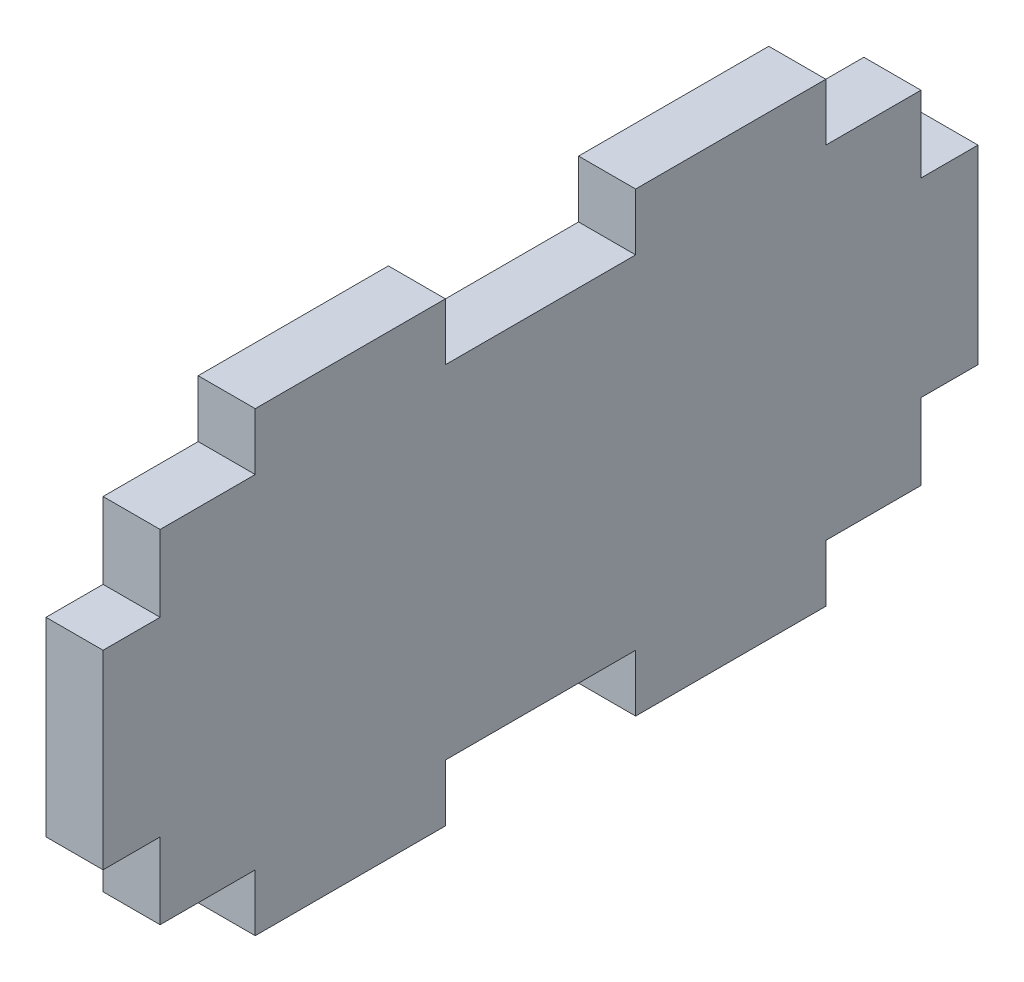
ISO-10303-21;
HEADER;
FILE_DESCRIPTION(('STEP AP214'),'2;1');
FILE_NAME('part.step','',(''),(''),'','','');
FILE_SCHEMA(('AUTOMOTIVE_DESIGN { 1 0 10303 214 1 1 1 1 }'));
ENDSEC;
DATA;
#1=APPLICATION_CONTEXT('core data for automotive mechanical design processes');
#2=APPLICATION_PROTOCOL_DEFINITION('international standard','automotive_design',2000,#1);
#3=PRODUCT_CONTEXT('',#1,'mechanical');
#4=PRODUCT('Part','Part','',(#3));
#5=PRODUCT_RELATED_PRODUCT_CATEGORY('part','',(#4));
#6=PRODUCT_DEFINITION_FORMATION('','',#4);
#7=PRODUCT_DEFINITION_CONTEXT('part definition',#1,'design');
#8=PRODUCT_DEFINITION('design','',#6,#7);
#9=PRODUCT_DEFINITION_SHAPE('','',#8);
#10=(LENGTH_UNIT() NAMED_UNIT(*) SI_UNIT(.MILLI.,.METRE.));
#11=(NAMED_UNIT(*) PLANE_ANGLE_UNIT() SI_UNIT($,.RADIAN.));
#12=(NAMED_UNIT(*) SI_UNIT($,.STERADIAN.) SOLID_ANGLE_UNIT());
#13=UNCERTAINTY_MEASURE_WITH_UNIT(LENGTH_MEASURE(1.E-05),#10,'distance_accuracy_value','');
#14=(GEOMETRIC_REPRESENTATION_CONTEXT(3) GLOBAL_UNCERTAINTY_ASSIGNED_CONTEXT((#13)) GLOBAL_UNIT_ASSIGNED_CONTEXT((#10,
#11,#12)) REPRESENTATION_CONTEXT('',''));
#15=CARTESIAN_POINT('',(0.,0.,0.));
#16=DIRECTION('',(0.,0.,1.));
#17=DIRECTION('',(1.,0.,0.));
#18=AXIS2_PLACEMENT_3D('',#15,#16,#17);
#19=CARTESIAN_POINT('',(3.,0.,0.));
#20=DIRECTION('',(-1.,0.,0.));
#21=DIRECTION('',(0.,0.,1.));
#22=AXIS2_PLACEMENT_3D('',#19,#20,#21);
#23=PLANE('',#22);
#24=DIRECTION('',(0.,0.,-1.));
#25=VECTOR('',#24,1.);
#26=CARTESIAN_POINT('',(3.,9.,0.));
#27=LINE('',#26,#25);
#28=CARTESIAN_POINT('',(3.,9.,5.));
#29=VERTEX_POINT('',#28);
#30=CARTESIAN_POINT('',(3.,9.,-5.));
#31=VERTEX_POINT('',#30);
#32=EDGE_CURVE('E307',#29,#31,#27,.T.);
#33=ORIENTED_EDGE('',*,*,#32,.F.);
#34=DIRECTION('',(0.,1.,0.));
#35=VECTOR('',#34,1.);
#36=CARTESIAN_POINT('',(3.,12.,5.));
#37=LINE('',#36,#35);
#38=CARTESIAN_POINT('',(3.,12.,5.));
#39=VERTEX_POINT('',#38);
#40=EDGE_CURVE('E232',#29,#39,#37,.T.);
#41=ORIENTED_EDGE('',*,*,#40,.T.);
#42=DIRECTION('',(0.,0.,-1.));
#43=VECTOR('',#42,1.);
#44=CARTESIAN_POINT('',(3.,12.,23.));
#45=LINE('',#44,#43);
#46=CARTESIAN_POINT('',(3.,12.,15.));
#47=VERTEX_POINT('',#46);
#48=EDGE_CURVE('E241',#47,#39,#45,.T.);
#49=ORIENTED_EDGE('',*,*,#48,.F.);
#50=DIRECTION('',(0.,-1.,0.));
#51=VECTOR('',#50,1.);
#52=CARTESIAN_POINT('',(3.,9.,15.));
#53=LINE('',#52,#51);
#54=CARTESIAN_POINT('',(3.,9.,15.));
#55=VERTEX_POINT('',#54);
#56=EDGE_CURVE('E413',#47,#55,#53,.T.);
#57=ORIENTED_EDGE('',*,*,#56,.T.);
#58=DIRECTION('',(0.,0.,1.));
#59=VECTOR('',#58,1.);
#60=CARTESIAN_POINT('',(3.,9.,20.));
#61=LINE('',#60,#59);
#62=CARTESIAN_POINT('',(3.,9.,20.));
#63=VERTEX_POINT('',#62);
#64=EDGE_CURVE('E416',#55,#63,#61,.T.);
#65=ORIENTED_EDGE('',*,*,#64,.T.);
#66=DIRECTION('',(0.,-1.,0.));
#67=VECTOR('',#66,1.);
#68=CARTESIAN_POINT('',(3.,5.,20.));
#69=LINE('',#68,#67);
#70=CARTESIAN_POINT('',(3.,5.,20.));
#71=VERTEX_POINT('',#70);
#72=EDGE_CURVE('E419',#63,#71,#69,.T.);
#73=ORIENTED_EDGE('',*,*,#72,.T.);
#74=DIRECTION('',(0.,0.,1.));
#75=VECTOR('',#74,1.);
#76=CARTESIAN_POINT('',(3.,5.,23.));
#77=LINE('',#76,#75);
#78=CARTESIAN_POINT('',(3.,5.,23.));
#79=VERTEX_POINT('',#78);
#80=EDGE_CURVE('E422',#71,#79,#77,.T.);
#81=ORIENTED_EDGE('',*,*,#80,.T.);
#82=DIRECTION('',(0.,1.,0.));
#83=VECTOR('',#82,1.);
#84=CARTESIAN_POINT('',(3.,-12.,23.));
#85=LINE('',#84,#83);
#86=CARTESIAN_POINT('',(3.,-5.,23.));
#87=VERTEX_POINT('',#86);
#88=EDGE_CURVE('E260',#87,#79,#85,.T.);
#89=ORIENTED_EDGE('',*,*,#88,.F.);
#90=DIRECTION('',(0.,0.,1.));
#91=VECTOR('',#90,1.);
#92=CARTESIAN_POINT('',(3.,-5.,23.));
#93=LINE('',#92,#91);
#94=CARTESIAN_POINT('',(3.,-5.,20.));
#95=VERTEX_POINT('',#94);
#96=EDGE_CURVE('E58',#95,#87,#93,.T.);
#97=ORIENTED_EDGE('',*,*,#96,.F.);
#98=DIRECTION('',(0.,1.,0.));
#99=VECTOR('',#98,1.);
#100=CARTESIAN_POINT('',(3.,-5.,20.));
#101=LINE('',#100,#99);
#102=CARTESIAN_POINT('',(3.,-9.,20.));
#103=VERTEX_POINT('',#102);
#104=EDGE_CURVE('E373',#103,#95,#101,.T.);
#105=ORIENTED_EDGE('',*,*,#104,.F.);
#106=DIRECTION('',(0.,0.,1.));
#107=VECTOR('',#106,1.);
#108=CARTESIAN_POINT('',(3.,-9.,20.));
#109=LINE('',#108,#107);
#110=CARTESIAN_POINT('',(3.,-9.,15.));
#111=VERTEX_POINT('',#110);
#112=EDGE_CURVE('E376',#111,#103,#109,.T.);
#113=ORIENTED_EDGE('',*,*,#112,.F.);
#114=DIRECTION('',(0.,1.,0.));
#115=VECTOR('',#114,1.);
#116=CARTESIAN_POINT('',(3.,-9.,15.));
#117=LINE('',#116,#115);
#118=CARTESIAN_POINT('',(3.,-12.,15.));
#119=VERTEX_POINT('',#118);
#120=EDGE_CURVE('E379',#119,#111,#117,.T.);
#121=ORIENTED_EDGE('',*,*,#120,.F.);
#122=DIRECTION('',(0.,0.,-1.));
#123=VECTOR('',#122,1.);
#124=CARTESIAN_POINT('',(3.,-12.,23.));
#125=LINE('',#124,#123);
#126=CARTESIAN_POINT('',(3.,-12.,5.));
#127=VERTEX_POINT('',#126);
#128=EDGE_CURVE('E11',#119,#127,#125,.T.);
#129=ORIENTED_EDGE('',*,*,#128,.T.);
#130=DIRECTION('',(0.,-1.,0.));
#131=VECTOR('',#130,1.);
#132=CARTESIAN_POINT('',(3.,-12.,5.));
#133=LINE('',#132,#131);
#134=CARTESIAN_POINT('',(3.,-9.,5.));
#135=VERTEX_POINT('',#134);
#136=EDGE_CURVE('E399',#135,#127,#133,.T.);
#137=ORIENTED_EDGE('',*,*,#136,.F.);
#138=DIRECTION('',(0.,0.,-1.));
#139=VECTOR('',#138,1.);
#140=CARTESIAN_POINT('',(3.,-9.,0.));
#141=LINE('',#140,#139);
#142=CARTESIAN_POINT('',(3.,-9.,-5.));
#143=VERTEX_POINT('',#142);
#144=EDGE_CURVE('E350',#135,#143,#141,.T.);
#145=ORIENTED_EDGE('',*,*,#144,.T.);
#146=DIRECTION('',(0.,-1.,0.));
#147=VECTOR('',#146,1.);
#148=CARTESIAN_POINT('',(3.,-12.,-5.));
#149=LINE('',#148,#147);
#150=CARTESIAN_POINT('',(3.,-12.,-5.));
#151=VERTEX_POINT('',#150);
#152=EDGE_CURVE('E354',#143,#151,#149,.T.);
#153=ORIENTED_EDGE('',*,*,#152,.T.);
#154=CARTESIAN_POINT('',(3.,-12.,-15.));
#155=VERTEX_POINT('',#154);
#156=EDGE_CURVE('E42',#151,#155,#125,.T.);
#157=ORIENTED_EDGE('',*,*,#156,.T.);
#158=DIRECTION('',(0.,1.,0.));
#159=VECTOR('',#158,1.);
#160=CARTESIAN_POINT('',(3.,-9.,-15.));
#161=LINE('',#160,#159);
#162=CARTESIAN_POINT('',(3.,-9.,-15.));
#163=VERTEX_POINT('',#162);
#164=EDGE_CURVE('E325',#155,#163,#161,.T.);
#165=ORIENTED_EDGE('',*,*,#164,.T.);
#166=DIRECTION('',(0.,0.,-1.));
#167=VECTOR('',#166,1.);
#168=CARTESIAN_POINT('',(3.,-9.,-20.));
#169=LINE('',#168,#167);
#170=CARTESIAN_POINT('',(3.,-9.,-20.));
#171=VERTEX_POINT('',#170);
#172=EDGE_CURVE('E329',#163,#171,#169,.T.);
#173=ORIENTED_EDGE('',*,*,#172,.T.);
#174=DIRECTION('',(0.,1.,0.));
#175=VECTOR('',#174,1.);
#176=CARTESIAN_POINT('',(3.,-5.,-20.));
#177=LINE('',#176,#175);
#178=CARTESIAN_POINT('',(3.,-5.,-20.));
#179=VERTEX_POINT('',#178);
#180=EDGE_CURVE('E332',#171,#179,#177,.T.);
#181=ORIENTED_EDGE('',*,*,#180,.T.);
#182=DIRECTION('',(0.,0.,-1.));
#183=VECTOR('',#182,1.);
#184=CARTESIAN_POINT('',(3.,-5.,-23.));
#185=LINE('',#184,#183);
#186=CARTESIAN_POINT('',(3.,-5.,-23.));
#187=VERTEX_POINT('',#186);
#188=EDGE_CURVE('E335',#179,#187,#185,.T.);
#189=ORIENTED_EDGE('',*,*,#188,.T.);
#190=DIRECTION('',(0.,1.,0.));
#191=VECTOR('',#190,1.);
#192=CARTESIAN_POINT('',(3.,-12.,-23.));
#193=LINE('',#192,#191);
#194=CARTESIAN_POINT('',(3.,5.,-23.));
#195=VERTEX_POINT('',#194);
#196=EDGE_CURVE('E256',#187,#195,#193,.T.);
#197=ORIENTED_EDGE('',*,*,#196,.T.);
#198=DIRECTION('',(0.,0.,-1.));
#199=VECTOR('',#198,1.);
#200=CARTESIAN_POINT('',(3.,5.,-23.));
#201=LINE('',#200,#199);
#202=CARTESIAN_POINT('',(3.,5.,-20.));
#203=VERTEX_POINT('',#202);
#204=EDGE_CURVE('E275',#203,#195,#201,.T.);
#205=ORIENTED_EDGE('',*,*,#204,.F.);
#206=DIRECTION('',(0.,-1.,0.));
#207=VECTOR('',#206,1.);
#208=CARTESIAN_POINT('',(3.,5.,-20.));
#209=LINE('',#208,#207);
#210=CARTESIAN_POINT('',(3.,9.,-20.));
#211=VERTEX_POINT('',#210);
#212=EDGE_CURVE('E279',#211,#203,#209,.T.);
#213=ORIENTED_EDGE('',*,*,#212,.F.);
#214=DIRECTION('',(0.,0.,-1.));
#215=VECTOR('',#214,1.);
#216=CARTESIAN_POINT('',(3.,9.,-20.));
#217=LINE('',#216,#215);
#218=CARTESIAN_POINT('',(3.,9.,-15.));
#219=VERTEX_POINT('',#218);
#220=EDGE_CURVE('E282',#219,#211,#217,.T.);
#221=ORIENTED_EDGE('',*,*,#220,.F.);
#222=DIRECTION('',(0.,-1.,0.));
#223=VECTOR('',#222,1.);
#224=CARTESIAN_POINT('',(3.,9.,-15.));
#225=LINE('',#224,#223);
#226=CARTESIAN_POINT('',(3.,12.,-15.));
#227=VERTEX_POINT('',#226);
#228=EDGE_CURVE('E285',#227,#219,#225,.T.);
#229=ORIENTED_EDGE('',*,*,#228,.F.);
#230=CARTESIAN_POINT('',(3.,12.,-5.));
#231=VERTEX_POINT('',#230);
#232=EDGE_CURVE('E259',#231,#227,#45,.T.);
#233=ORIENTED_EDGE('',*,*,#232,.F.);
#234=DIRECTION('',(0.,1.,0.));
#235=VECTOR('',#234,1.);
#236=CARTESIAN_POINT('',(3.,12.,-5.));
#237=LINE('',#236,#235);
#238=EDGE_CURVE('E304',#31,#231,#237,.T.);
#239=ORIENTED_EDGE('',*,*,#238,.F.);
#240=EDGE_LOOP('',(#33,#41,#49,#57,#65,#73,#81,#89,#97,#105,#113,#121,#129,#137,#145,#153,#157,
#165,#173,#181,#189,#197,#205,#213,#221,#229,#233,#239));
#241=FACE_BOUND('',#240,.T.);
#242=ADVANCED_FACE('F33',(#241),#23,.F.);
#243=CARTESIAN_POINT('',(0.,0.,0.));
#244=DIRECTION('',(-1.,0.,0.));
#245=DIRECTION('',(0.,0.,1.));
#246=AXIS2_PLACEMENT_3D('',#243,#244,#245);
#247=PLANE('',#246);
#248=DIRECTION('',(0.,1.,0.));
#249=VECTOR('',#248,1.);
#250=CARTESIAN_POINT('',(0.,12.,5.));
#251=LINE('',#250,#249);
#252=CARTESIAN_POINT('',(0.,9.,5.));
#253=VERTEX_POINT('',#252);
#254=CARTESIAN_POINT('',(0.,12.,5.));
#255=VERTEX_POINT('',#254);
#256=EDGE_CURVE('E221',#253,#255,#251,.T.);
#257=ORIENTED_EDGE('',*,*,#256,.F.);
#258=DIRECTION('',(0.,0.,-1.));
#259=VECTOR('',#258,1.);
#260=CARTESIAN_POINT('',(0.,9.,0.));
#261=LINE('',#260,#259);
#262=CARTESIAN_POINT('',(0.,9.,-5.));
#263=VERTEX_POINT('',#262);
#264=EDGE_CURVE('E306',#253,#263,#261,.T.);
#265=ORIENTED_EDGE('',*,*,#264,.T.);
#266=DIRECTION('',(0.,1.,0.));
#267=VECTOR('',#266,1.);
#268=CARTESIAN_POINT('',(0.,12.,-5.));
#269=LINE('',#268,#267);
#270=CARTESIAN_POINT('',(0.,12.,-5.));
#271=VERTEX_POINT('',#270);
#272=EDGE_CURVE('E301',#263,#271,#269,.T.);
#273=ORIENTED_EDGE('',*,*,#272,.T.);
#274=DIRECTION('',(0.,0.,-1.));
#275=VECTOR('',#274,1.);
#276=CARTESIAN_POINT('',(0.,12.,23.));
#277=LINE('',#276,#275);
#278=CARTESIAN_POINT('',(0.,12.,-15.));
#279=VERTEX_POINT('',#278);
#280=EDGE_CURVE('E248',#271,#279,#277,.T.);
#281=ORIENTED_EDGE('',*,*,#280,.T.);
#282=DIRECTION('',(0.,-1.,0.));
#283=VECTOR('',#282,1.);
#284=CARTESIAN_POINT('',(0.,9.,-15.));
#285=LINE('',#284,#283);
#286=CARTESIAN_POINT('',(0.,9.,-15.));
#287=VERTEX_POINT('',#286);
#288=EDGE_CURVE('E278',#279,#287,#285,.T.);
#289=ORIENTED_EDGE('',*,*,#288,.T.);
#290=DIRECTION('',(0.,0.,-1.));
#291=VECTOR('',#290,1.);
#292=CARTESIAN_POINT('',(0.,9.,-20.));
#293=LINE('',#292,#291);
#294=CARTESIAN_POINT('',(0.,9.,-20.));
#295=VERTEX_POINT('',#294);
#296=EDGE_CURVE('E294',#287,#295,#293,.T.);
#297=ORIENTED_EDGE('',*,*,#296,.T.);
#298=DIRECTION('',(0.,-1.,0.));
#299=VECTOR('',#298,1.);
#300=CARTESIAN_POINT('',(0.,5.,-20.));
#301=LINE('',#300,#299);
#302=CARTESIAN_POINT('',(0.,5.,-20.));
#303=VERTEX_POINT('',#302);
#304=EDGE_CURVE('E291',#295,#303,#301,.T.);
#305=ORIENTED_EDGE('',*,*,#304,.T.);
#306=DIRECTION('',(0.,0.,-1.));
#307=VECTOR('',#306,1.);
#308=CARTESIAN_POINT('',(0.,5.,-23.));
#309=LINE('',#308,#307);
#310=CARTESIAN_POINT('',(0.,5.,-23.));
#311=VERTEX_POINT('',#310);
#312=EDGE_CURVE('E267',#303,#311,#309,.T.);
#313=ORIENTED_EDGE('',*,*,#312,.T.);
#314=DIRECTION('',(0.,1.,0.));
#315=VECTOR('',#314,1.);
#316=CARTESIAN_POINT('',(0.,-12.,-23.));
#317=LINE('',#316,#315);
#318=CARTESIAN_POINT('',(0.,-5.,-23.));
#319=VERTEX_POINT('',#318);
#320=EDGE_CURVE('E247',#319,#311,#317,.T.);
#321=ORIENTED_EDGE('',*,*,#320,.F.);
#322=DIRECTION('',(0.,0.,-1.));
#323=VECTOR('',#322,1.);
#324=CARTESIAN_POINT('',(0.,-5.,-23.));
#325=LINE('',#324,#323);
#326=CARTESIAN_POINT('',(0.,-5.,-20.));
#327=VERTEX_POINT('',#326);
#328=EDGE_CURVE('E328',#327,#319,#325,.T.);
#329=ORIENTED_EDGE('',*,*,#328,.F.);
#330=DIRECTION('',(0.,1.,0.));
#331=VECTOR('',#330,1.);
#332=CARTESIAN_POINT('',(0.,-5.,-20.));
#333=LINE('',#332,#331);
#334=CARTESIAN_POINT('',(0.,-9.,-20.));
#335=VERTEX_POINT('',#334);
#336=EDGE_CURVE('E342',#335,#327,#333,.T.);
#337=ORIENTED_EDGE('',*,*,#336,.F.);
#338=DIRECTION('',(0.,0.,-1.));
#339=VECTOR('',#338,1.);
#340=CARTESIAN_POINT('',(0.,-9.,-20.));
#341=LINE('',#340,#339);
#342=CARTESIAN_POINT('',(0.,-9.,-15.));
#343=VERTEX_POINT('',#342);
#344=EDGE_CURVE('E340',#343,#335,#341,.T.);
#345=ORIENTED_EDGE('',*,*,#344,.F.);
#346=DIRECTION('',(0.,1.,0.));
#347=VECTOR('',#346,1.);
#348=CARTESIAN_POINT('',(0.,-9.,-15.));
#349=LINE('',#348,#347);
#350=CARTESIAN_POINT('',(0.,-12.,-15.));
#351=VERTEX_POINT('',#350);
#352=EDGE_CURVE('E317',#351,#343,#349,.T.);
#353=ORIENTED_EDGE('',*,*,#352,.F.);
#354=DIRECTION('',(0.,0.,-1.));
#355=VECTOR('',#354,1.);
#356=CARTESIAN_POINT('',(0.,-12.,23.));
#357=LINE('',#356,#355);
#358=CARTESIAN_POINT('',(0.,-12.,-5.));
#359=VERTEX_POINT('',#358);
#360=EDGE_CURVE('E250',#359,#351,#357,.T.);
#361=ORIENTED_EDGE('',*,*,#360,.F.);
#362=DIRECTION('',(0.,-1.,0.));
#363=VECTOR('',#362,1.);
#364=CARTESIAN_POINT('',(0.,-12.,-5.));
#365=LINE('',#364,#363);
#366=CARTESIAN_POINT('',(0.,-9.,-5.));
#367=VERTEX_POINT('',#366);
#368=EDGE_CURVE('E353',#367,#359,#365,.T.);
#369=ORIENTED_EDGE('',*,*,#368,.F.);
#370=DIRECTION('',(0.,0.,-1.));
#371=VECTOR('',#370,1.);
#372=CARTESIAN_POINT('',(0.,-9.,0.));
#373=LINE('',#372,#371);
#374=CARTESIAN_POINT('',(0.,-9.,5.));
#375=VERTEX_POINT('',#374);
#376=EDGE_CURVE('E348',#375,#367,#373,.T.);
#377=ORIENTED_EDGE('',*,*,#376,.F.);
#378=DIRECTION('',(0.,-1.,0.));
#379=VECTOR('',#378,1.);
#380=CARTESIAN_POINT('',(0.,-12.,5.));
#381=LINE('',#380,#379);
#382=CARTESIAN_POINT('',(0.,-12.,5.));
#383=VERTEX_POINT('',#382);
#384=EDGE_CURVE('E396',#375,#383,#381,.T.);
#385=ORIENTED_EDGE('',*,*,#384,.T.);
#386=CARTESIAN_POINT('',(0.,-12.,15.));
#387=VERTEX_POINT('',#386);
#388=EDGE_CURVE('E37',#387,#383,#357,.T.);
#389=ORIENTED_EDGE('',*,*,#388,.F.);
#390=DIRECTION('',(0.,1.,0.));
#391=VECTOR('',#390,1.);
#392=CARTESIAN_POINT('',(0.,-9.,15.));
#393=LINE('',#392,#391);
#394=CARTESIAN_POINT('',(0.,-9.,15.));
#395=VERTEX_POINT('',#394);
#396=EDGE_CURVE('E372',#387,#395,#393,.T.);
#397=ORIENTED_EDGE('',*,*,#396,.T.);
#398=DIRECTION('',(0.,0.,1.));
#399=VECTOR('',#398,1.);
#400=CARTESIAN_POINT('',(0.,-9.,20.));
#401=LINE('',#400,#399);
#402=CARTESIAN_POINT('',(0.,-9.,20.));
#403=VERTEX_POINT('',#402);
#404=EDGE_CURVE('E388',#395,#403,#401,.T.);
#405=ORIENTED_EDGE('',*,*,#404,.T.);
#406=DIRECTION('',(0.,1.,0.));
#407=VECTOR('',#406,1.);
#408=CARTESIAN_POINT('',(0.,-5.,20.));
#409=LINE('',#408,#407);
#410=CARTESIAN_POINT('',(0.,-5.,20.));
#411=VERTEX_POINT('',#410);
#412=EDGE_CURVE('E385',#403,#411,#409,.T.);
#413=ORIENTED_EDGE('',*,*,#412,.T.);
#414=DIRECTION('',(0.,0.,1.));
#415=VECTOR('',#414,1.);
#416=CARTESIAN_POINT('',(0.,-5.,23.));
#417=LINE('',#416,#415);
#418=CARTESIAN_POINT('',(0.,-5.,23.));
#419=VERTEX_POINT('',#418);
#420=EDGE_CURVE('E364',#411,#419,#417,.T.);
#421=ORIENTED_EDGE('',*,*,#420,.T.);
#422=DIRECTION('',(0.,1.,0.));
#423=VECTOR('',#422,1.);
#424=CARTESIAN_POINT('',(0.,-12.,23.));
#425=LINE('',#424,#423);
#426=CARTESIAN_POINT('',(0.,5.,23.));
#427=VERTEX_POINT('',#426);
#428=EDGE_CURVE('E251',#419,#427,#425,.T.);
#429=ORIENTED_EDGE('',*,*,#428,.T.);
#430=DIRECTION('',(0.,0.,1.));
#431=VECTOR('',#430,1.);
#432=CARTESIAN_POINT('',(0.,5.,23.));
#433=LINE('',#432,#431);
#434=CARTESIAN_POINT('',(0.,5.,20.));
#435=VERTEX_POINT('',#434);
#436=EDGE_CURVE('E50',#435,#427,#433,.T.);
#437=ORIENTED_EDGE('',*,*,#436,.F.);
#438=DIRECTION('',(0.,-1.,0.));
#439=VECTOR('',#438,1.);
#440=CARTESIAN_POINT('',(0.,5.,20.));
#441=LINE('',#440,#439);
#442=CARTESIAN_POINT('',(0.,9.,20.));
#443=VERTEX_POINT('',#442);
#444=EDGE_CURVE('E428',#443,#435,#441,.T.);
#445=ORIENTED_EDGE('',*,*,#444,.F.);
#446=DIRECTION('',(0.,0.,1.));
#447=VECTOR('',#446,1.);
#448=CARTESIAN_POINT('',(0.,9.,20.));
#449=LINE('',#448,#447);
#450=CARTESIAN_POINT('',(0.,9.,15.));
#451=VERTEX_POINT('',#450);
#452=EDGE_CURVE('E426',#451,#443,#449,.T.);
#453=ORIENTED_EDGE('',*,*,#452,.F.);
#454=DIRECTION('',(0.,-1.,0.));
#455=VECTOR('',#454,1.);
#456=CARTESIAN_POINT('',(0.,9.,15.));
#457=LINE('',#456,#455);
#458=CARTESIAN_POINT('',(0.,12.,15.));
#459=VERTEX_POINT('',#458);
#460=EDGE_CURVE('E246',#459,#451,#457,.T.);
#461=ORIENTED_EDGE('',*,*,#460,.F.);
#462=EDGE_CURVE('E239',#459,#255,#277,.T.);
#463=ORIENTED_EDGE('',*,*,#462,.T.);
#464=EDGE_LOOP('',(#257,#265,#273,#281,#289,#297,#305,#313,#321,#329,#337,#345,#353,#361,#369,
#377,#385,#389,#397,#405,#413,#421,#429,#437,#445,#453,#461,#463));
#465=FACE_BOUND('',#464,.T.);
#466=ADVANCED_FACE('F244',(#465),#247,.T.);
#467=CARTESIAN_POINT('',(3.,12.,23.));
#468=DIRECTION('',(0.,1.,0.));
#469=DIRECTION('',(0.,0.,1.));
#470=AXIS2_PLACEMENT_3D('',#467,#468,#469);
#471=PLANE('',#470);
#472=ORIENTED_EDGE('',*,*,#48,.T.);
#473=DIRECTION('',(1.,0.,0.));
#474=VECTOR('',#473,1.);
#475=CARTESIAN_POINT('',(0.,12.,5.));
#476=LINE('',#475,#474);
#477=EDGE_CURVE('E225',#255,#39,#476,.T.);
#478=ORIENTED_EDGE('',*,*,#477,.F.);
#479=ORIENTED_EDGE('',*,*,#462,.F.);
#480=DIRECTION('',(1.,0.,0.));
#481=VECTOR('',#480,1.);
#482=CARTESIAN_POINT('',(0.,12.,15.));
#483=LINE('',#482,#481);
#484=EDGE_CURVE('E401',#459,#47,#483,.T.);
#485=ORIENTED_EDGE('',*,*,#484,.T.);
#486=EDGE_LOOP('',(#472,#478,#479,#485));
#487=FACE_BOUND('',#486,.T.);
#488=ADVANCED_FACE('F237',(#487),#471,.T.);
#489=CARTESIAN_POINT('',(3.,-12.,23.));
#490=DIRECTION('',(0.,0.,1.));
#491=DIRECTION('',(1.,0.,0.));
#492=AXIS2_PLACEMENT_3D('',#489,#490,#491);
#493=PLANE('',#492);
#494=ORIENTED_EDGE('',*,*,#88,.T.);
#495=DIRECTION('',(1.,0.,0.));
#496=VECTOR('',#495,1.);
#497=CARTESIAN_POINT('',(0.,5.,23.));
#498=LINE('',#497,#496);
#499=EDGE_CURVE('E404',#427,#79,#498,.T.);
#500=ORIENTED_EDGE('',*,*,#499,.F.);
#501=ORIENTED_EDGE('',*,*,#428,.F.);
#502=DIRECTION('',(1.,0.,0.));
#503=VECTOR('',#502,1.);
#504=CARTESIAN_POINT('',(0.,-5.,23.));
#505=LINE('',#504,#503);
#506=EDGE_CURVE('E357',#419,#87,#505,.T.);
#507=ORIENTED_EDGE('',*,*,#506,.T.);
#508=EDGE_LOOP('',(#494,#500,#501,#507));
#509=FACE_BOUND('',#508,.T.);
#510=ADVANCED_FACE('F35',(#509),#493,.T.);
#511=CARTESIAN_POINT('',(3.,-12.,23.));
#512=DIRECTION('',(0.,1.,0.));
#513=DIRECTION('',(0.,0.,1.));
#514=AXIS2_PLACEMENT_3D('',#511,#512,#513);
#515=PLANE('',#514);
#516=ORIENTED_EDGE('',*,*,#388,.T.);
#517=DIRECTION('',(1.,0.,0.));
#518=VECTOR('',#517,1.);
#519=CARTESIAN_POINT('',(0.,-12.,5.));
#520=LINE('',#519,#518);
#521=EDGE_CURVE('E382',#383,#127,#520,.T.);
#522=ORIENTED_EDGE('',*,*,#521,.T.);
#523=ORIENTED_EDGE('',*,*,#128,.F.);
#524=DIRECTION('',(1.,0.,0.));
#525=VECTOR('',#524,1.);
#526=CARTESIAN_POINT('',(0.,-12.,15.));
#527=LINE('',#526,#525);
#528=EDGE_CURVE('E361',#387,#119,#527,.T.);
#529=ORIENTED_EDGE('',*,*,#528,.F.);
#530=EDGE_LOOP('',(#516,#522,#523,#529));
#531=FACE_BOUND('',#530,.T.);
#532=ADVANCED_FACE('F494',(#531),#515,.F.);
#533=DIRECTION('',(1.,0.,0.));
#534=VECTOR('',#533,1.);
#535=CARTESIAN_POINT('',(0.,-12.,-5.));
#536=LINE('',#535,#534);
#537=EDGE_CURVE('E346',#359,#151,#536,.T.);
#538=ORIENTED_EDGE('',*,*,#537,.F.);
#539=ORIENTED_EDGE('',*,*,#360,.T.);
#540=DIRECTION('',(1.,0.,0.));
#541=VECTOR('',#540,1.);
#542=CARTESIAN_POINT('',(0.,-12.,-15.));
#543=LINE('',#542,#541);
#544=EDGE_CURVE('E310',#351,#155,#543,.T.);
#545=ORIENTED_EDGE('',*,*,#544,.T.);
#546=ORIENTED_EDGE('',*,*,#156,.F.);
#547=EDGE_LOOP('',(#538,#539,#545,#546));
#548=FACE_BOUND('',#547,.T.);
#549=ADVANCED_FACE('F489',(#548),#515,.F.);
#550=CARTESIAN_POINT('',(3.,-12.,-23.));
#551=DIRECTION('',(0.,0.,1.));
#552=DIRECTION('',(1.,0.,0.));
#553=AXIS2_PLACEMENT_3D('',#550,#551,#552);
#554=PLANE('',#553);
#555=DIRECTION('',(1.,0.,0.));
#556=VECTOR('',#555,1.);
#557=CARTESIAN_POINT('',(0.,-5.,-23.));
#558=LINE('',#557,#556);
#559=EDGE_CURVE('E314',#319,#187,#558,.T.);
#560=ORIENTED_EDGE('',*,*,#559,.F.);
#561=ORIENTED_EDGE('',*,*,#320,.T.);
#562=DIRECTION('',(1.,0.,0.));
#563=VECTOR('',#562,1.);
#564=CARTESIAN_POINT('',(0.,5.,-23.));
#565=LINE('',#564,#563);
#566=EDGE_CURVE('E254',#311,#195,#565,.T.);
#567=ORIENTED_EDGE('',*,*,#566,.T.);
#568=ORIENTED_EDGE('',*,*,#196,.F.);
#569=EDGE_LOOP('',(#560,#561,#567,#568));
#570=FACE_BOUND('',#569,.T.);
#571=ADVANCED_FACE('F464',(#570),#554,.F.);
#572=DIRECTION('',(1.,0.,0.));
#573=VECTOR('',#572,1.);
#574=CARTESIAN_POINT('',(0.,12.,-5.));
#575=LINE('',#574,#573);
#576=EDGE_CURVE('E288',#271,#231,#575,.T.);
#577=ORIENTED_EDGE('',*,*,#576,.T.);
#578=ORIENTED_EDGE('',*,*,#232,.T.);
#579=DIRECTION('',(1.,0.,0.));
#580=VECTOR('',#579,1.);
#581=CARTESIAN_POINT('',(0.,12.,-15.));
#582=LINE('',#581,#580);
#583=EDGE_CURVE('E263',#279,#227,#582,.T.);
#584=ORIENTED_EDGE('',*,*,#583,.F.);
#585=ORIENTED_EDGE('',*,*,#280,.F.);
#586=EDGE_LOOP('',(#577,#578,#584,#585));
#587=FACE_BOUND('',#586,.T.);
#588=ADVANCED_FACE('F443',(#587),#471,.T.);
#589=CARTESIAN_POINT('',(0.,5.,-23.));
#590=DIRECTION('',(0.,-1.,0.));
#591=DIRECTION('',(0.,0.,-1.));
#592=AXIS2_PLACEMENT_3D('',#589,#590,#591);
#593=PLANE('',#592);
#594=ORIENTED_EDGE('',*,*,#204,.T.);
#595=ORIENTED_EDGE('',*,*,#566,.F.);
#596=ORIENTED_EDGE('',*,*,#312,.F.);
#597=DIRECTION('',(1.,0.,0.));
#598=VECTOR('',#597,1.);
#599=CARTESIAN_POINT('',(0.,5.,-20.));
#600=LINE('',#599,#598);
#601=EDGE_CURVE('E271',#303,#203,#600,.T.);
#602=ORIENTED_EDGE('',*,*,#601,.T.);
#603=EDGE_LOOP('',(#594,#595,#596,#602));
#604=FACE_BOUND('',#603,.T.);
#605=ADVANCED_FACE('F460',(#604),#593,.F.);
#606=CARTESIAN_POINT('',(0.,5.,-20.));
#607=DIRECTION('',(0.,0.,1.));
#608=DIRECTION('',(1.,0.,0.));
#609=AXIS2_PLACEMENT_3D('',#606,#607,#608);
#610=PLANE('',#609);
#611=ORIENTED_EDGE('',*,*,#212,.T.);
#612=ORIENTED_EDGE('',*,*,#601,.F.);
#613=ORIENTED_EDGE('',*,*,#304,.F.);
#614=DIRECTION('',(1.,0.,0.));
#615=VECTOR('',#614,1.);
#616=CARTESIAN_POINT('',(0.,9.,-20.));
#617=LINE('',#616,#615);
#618=EDGE_CURVE('E269',#295,#211,#617,.T.);
#619=ORIENTED_EDGE('',*,*,#618,.T.);
#620=EDGE_LOOP('',(#611,#612,#613,#619));
#621=FACE_BOUND('',#620,.T.);
#622=ADVANCED_FACE('F457',(#621),#610,.F.);
#623=CARTESIAN_POINT('',(0.,9.,-20.));
#624=DIRECTION('',(0.,-1.,0.));
#625=DIRECTION('',(0.,0.,-1.));
#626=AXIS2_PLACEMENT_3D('',#623,#624,#625);
#627=PLANE('',#626);
#628=ORIENTED_EDGE('',*,*,#220,.T.);
#629=ORIENTED_EDGE('',*,*,#618,.F.);
#630=ORIENTED_EDGE('',*,*,#296,.F.);
#631=DIRECTION('',(1.,0.,0.));
#632=VECTOR('',#631,1.);
#633=CARTESIAN_POINT('',(0.,9.,-15.));
#634=LINE('',#633,#632);
#635=EDGE_CURVE('E266',#287,#219,#634,.T.);
#636=ORIENTED_EDGE('',*,*,#635,.T.);
#637=EDGE_LOOP('',(#628,#629,#630,#636));
#638=FACE_BOUND('',#637,.T.);
#639=ADVANCED_FACE('F452',(#638),#627,.F.);
#640=CARTESIAN_POINT('',(0.,9.,-15.));
#641=DIRECTION('',(0.,0.,1.));
#642=DIRECTION('',(1.,0.,0.));
#643=AXIS2_PLACEMENT_3D('',#640,#641,#642);
#644=PLANE('',#643);
#645=ORIENTED_EDGE('',*,*,#228,.T.);
#646=ORIENTED_EDGE('',*,*,#635,.F.);
#647=ORIENTED_EDGE('',*,*,#288,.F.);
#648=ORIENTED_EDGE('',*,*,#583,.T.);
#649=EDGE_LOOP('',(#645,#646,#647,#648));
#650=FACE_BOUND('',#649,.T.);
#651=ADVANCED_FACE('F446',(#650),#644,.F.);
#652=CARTESIAN_POINT('',(0.,12.,-5.));
#653=DIRECTION('',(0.,0.,-1.));
#654=DIRECTION('',(-1.,0.,0.));
#655=AXIS2_PLACEMENT_3D('',#652,#653,#654);
#656=PLANE('',#655);
#657=ORIENTED_EDGE('',*,*,#238,.T.);
#658=ORIENTED_EDGE('',*,*,#576,.F.);
#659=ORIENTED_EDGE('',*,*,#272,.F.);
#660=DIRECTION('',(1.,0.,0.));
#661=VECTOR('',#660,1.);
#662=CARTESIAN_POINT('',(0.,9.,-5.));
#663=LINE('',#662,#661);
#664=EDGE_CURVE('E299',#263,#31,#663,.T.);
#665=ORIENTED_EDGE('',*,*,#664,.T.);
#666=EDGE_LOOP('',(#657,#658,#659,#665));
#667=FACE_BOUND('',#666,.T.);
#668=ADVANCED_FACE('F649',(#667),#656,.F.);
#669=CARTESIAN_POINT('',(0.,9.,0.));
#670=DIRECTION('',(0.,-1.,0.));
#671=DIRECTION('',(0.,0.,-1.));
#672=AXIS2_PLACEMENT_3D('',#669,#670,#671);
#673=PLANE('',#672);
#674=ORIENTED_EDGE('',*,*,#32,.T.);
#675=ORIENTED_EDGE('',*,*,#664,.F.);
#676=ORIENTED_EDGE('',*,*,#264,.F.);
#677=DIRECTION('',(1.,0.,0.));
#678=VECTOR('',#677,1.);
#679=CARTESIAN_POINT('',(0.,9.,5.));
#680=LINE('',#679,#678);
#681=EDGE_CURVE('E228',#253,#29,#680,.T.);
#682=ORIENTED_EDGE('',*,*,#681,.T.);
#683=EDGE_LOOP('',(#674,#675,#676,#682));
#684=FACE_BOUND('',#683,.T.);
#685=ADVANCED_FACE('F437',(#684),#673,.F.);
#686=CARTESIAN_POINT('',(0.,-9.,-15.));
#687=DIRECTION('',(0.,0.,-1.));
#688=DIRECTION('',(-1.,0.,0.));
#689=AXIS2_PLACEMENT_3D('',#686,#687,#688);
#690=PLANE('',#689);
#691=ORIENTED_EDGE('',*,*,#164,.F.);
#692=ORIENTED_EDGE('',*,*,#544,.F.);
#693=ORIENTED_EDGE('',*,*,#352,.T.);
#694=DIRECTION('',(1.,0.,0.));
#695=VECTOR('',#694,1.);
#696=CARTESIAN_POINT('',(0.,-9.,-15.));
#697=LINE('',#696,#695);
#698=EDGE_CURVE('E321',#343,#163,#697,.T.);
#699=ORIENTED_EDGE('',*,*,#698,.T.);
#700=EDGE_LOOP('',(#691,#692,#693,#699));
#701=FACE_BOUND('',#700,.T.);
#702=ADVANCED_FACE('F485',(#701),#690,.T.);
#703=CARTESIAN_POINT('',(0.,-9.,-20.));
#704=DIRECTION('',(0.,-1.,0.));
#705=DIRECTION('',(0.,0.,-1.));
#706=AXIS2_PLACEMENT_3D('',#703,#704,#705);
#707=PLANE('',#706);
#708=ORIENTED_EDGE('',*,*,#172,.F.);
#709=ORIENTED_EDGE('',*,*,#698,.F.);
#710=ORIENTED_EDGE('',*,*,#344,.T.);
#711=DIRECTION('',(1.,0.,0.));
#712=VECTOR('',#711,1.);
#713=CARTESIAN_POINT('',(0.,-9.,-20.));
#714=LINE('',#713,#712);
#715=EDGE_CURVE('E319',#335,#171,#714,.T.);
#716=ORIENTED_EDGE('',*,*,#715,.T.);
#717=EDGE_LOOP('',(#708,#709,#710,#716));
#718=FACE_BOUND('',#717,.T.);
#719=ADVANCED_FACE('F477',(#718),#707,.T.);
#720=CARTESIAN_POINT('',(0.,-5.,-20.));
#721=DIRECTION('',(0.,0.,-1.));
#722=DIRECTION('',(-1.,0.,0.));
#723=AXIS2_PLACEMENT_3D('',#720,#721,#722);
#724=PLANE('',#723);
#725=ORIENTED_EDGE('',*,*,#180,.F.);
#726=ORIENTED_EDGE('',*,*,#715,.F.);
#727=ORIENTED_EDGE('',*,*,#336,.T.);
#728=DIRECTION('',(1.,0.,0.));
#729=VECTOR('',#728,1.);
#730=CARTESIAN_POINT('',(0.,-5.,-20.));
#731=LINE('',#730,#729);
#732=EDGE_CURVE('E316',#327,#179,#731,.T.);
#733=ORIENTED_EDGE('',*,*,#732,.T.);
#734=EDGE_LOOP('',(#725,#726,#727,#733));
#735=FACE_BOUND('',#734,.T.);
#736=ADVANCED_FACE('F474',(#735),#724,.T.);
#737=CARTESIAN_POINT('',(0.,-5.,-23.));
#738=DIRECTION('',(0.,-1.,0.));
#739=DIRECTION('',(0.,0.,-1.));
#740=AXIS2_PLACEMENT_3D('',#737,#738,#739);
#741=PLANE('',#740);
#742=ORIENTED_EDGE('',*,*,#188,.F.);
#743=ORIENTED_EDGE('',*,*,#732,.F.);
#744=ORIENTED_EDGE('',*,*,#328,.T.);
#745=ORIENTED_EDGE('',*,*,#559,.T.);
#746=EDGE_LOOP('',(#742,#743,#744,#745));
#747=FACE_BOUND('',#746,.T.);
#748=ADVANCED_FACE('F470',(#747),#741,.T.);
#749=CARTESIAN_POINT('',(0.,-9.,0.));
#750=DIRECTION('',(0.,-1.,0.));
#751=DIRECTION('',(0.,0.,-1.));
#752=AXIS2_PLACEMENT_3D('',#749,#750,#751);
#753=PLANE('',#752);
#754=ORIENTED_EDGE('',*,*,#144,.F.);
#755=DIRECTION('',(1.,0.,0.));
#756=VECTOR('',#755,1.);
#757=CARTESIAN_POINT('',(0.,-9.,5.));
#758=LINE('',#757,#756);
#759=EDGE_CURVE('E393',#375,#135,#758,.T.);
#760=ORIENTED_EDGE('',*,*,#759,.F.);
#761=ORIENTED_EDGE('',*,*,#376,.T.);
#762=DIRECTION('',(1.,0.,0.));
#763=VECTOR('',#762,1.);
#764=CARTESIAN_POINT('',(0.,-9.,-5.));
#765=LINE('',#764,#763);
#766=EDGE_CURVE('E338',#367,#143,#765,.T.);
#767=ORIENTED_EDGE('',*,*,#766,.T.);
#768=EDGE_LOOP('',(#754,#760,#761,#767));
#769=FACE_BOUND('',#768,.T.);
#770=ADVANCED_FACE('F612',(#769),#753,.T.);
#771=CARTESIAN_POINT('',(0.,-12.,-5.));
#772=DIRECTION('',(0.,0.,1.));
#773=DIRECTION('',(1.,0.,0.));
#774=AXIS2_PLACEMENT_3D('',#771,#772,#773);
#775=PLANE('',#774);
#776=ORIENTED_EDGE('',*,*,#152,.F.);
#777=ORIENTED_EDGE('',*,*,#766,.F.);
#778=ORIENTED_EDGE('',*,*,#368,.T.);
#779=ORIENTED_EDGE('',*,*,#537,.T.);
#780=EDGE_LOOP('',(#776,#777,#778,#779));
#781=FACE_BOUND('',#780,.T.);
#782=ADVANCED_FACE('F619',(#781),#775,.T.);
#783=CARTESIAN_POINT('',(0.,-5.,23.));
#784=DIRECTION('',(0.,1.,0.));
#785=DIRECTION('',(0.,0.,1.));
#786=AXIS2_PLACEMENT_3D('',#783,#784,#785);
#787=PLANE('',#786);
#788=ORIENTED_EDGE('',*,*,#96,.T.);
#789=ORIENTED_EDGE('',*,*,#506,.F.);
#790=ORIENTED_EDGE('',*,*,#420,.F.);
#791=DIRECTION('',(1.,0.,0.));
#792=VECTOR('',#791,1.);
#793=CARTESIAN_POINT('',(0.,-5.,20.));
#794=LINE('',#793,#792);
#795=EDGE_CURVE('E368',#411,#95,#794,.T.);
#796=ORIENTED_EDGE('',*,*,#795,.T.);
#797=EDGE_LOOP('',(#788,#789,#790,#796));
#798=FACE_BOUND('',#797,.T.);
#799=ADVANCED_FACE('F514',(#798),#787,.F.);
#800=CARTESIAN_POINT('',(0.,-5.,20.));
#801=DIRECTION('',(0.,0.,-1.));
#802=DIRECTION('',(-1.,0.,0.));
#803=AXIS2_PLACEMENT_3D('',#800,#801,#802);
#804=PLANE('',#803);
#805=ORIENTED_EDGE('',*,*,#104,.T.);
#806=ORIENTED_EDGE('',*,*,#795,.F.);
#807=ORIENTED_EDGE('',*,*,#412,.F.);
#808=DIRECTION('',(1.,0.,0.));
#809=VECTOR('',#808,1.);
#810=CARTESIAN_POINT('',(0.,-9.,20.));
#811=LINE('',#810,#809);
#812=EDGE_CURVE('E366',#403,#103,#811,.T.);
#813=ORIENTED_EDGE('',*,*,#812,.T.);
#814=EDGE_LOOP('',(#805,#806,#807,#813));
#815=FACE_BOUND('',#814,.T.);
#816=ADVANCED_FACE('F513',(#815),#804,.F.);
#817=CARTESIAN_POINT('',(0.,-9.,20.));
#818=DIRECTION('',(0.,1.,0.));
#819=DIRECTION('',(0.,0.,1.));
#820=AXIS2_PLACEMENT_3D('',#817,#818,#819);
#821=PLANE('',#820);
#822=ORIENTED_EDGE('',*,*,#112,.T.);
#823=ORIENTED_EDGE('',*,*,#812,.F.);
#824=ORIENTED_EDGE('',*,*,#404,.F.);
#825=DIRECTION('',(1.,0.,0.));
#826=VECTOR('',#825,1.);
#827=CARTESIAN_POINT('',(0.,-9.,15.));
#828=LINE('',#827,#826);
#829=EDGE_CURVE('E363',#395,#111,#828,.T.);
#830=ORIENTED_EDGE('',*,*,#829,.T.);
#831=EDGE_LOOP('',(#822,#823,#824,#830));
#832=FACE_BOUND('',#831,.T.);
#833=ADVANCED_FACE('F508',(#832),#821,.F.);
#834=CARTESIAN_POINT('',(0.,-9.,15.));
#835=DIRECTION('',(0.,0.,-1.));
#836=DIRECTION('',(-1.,0.,0.));
#837=AXIS2_PLACEMENT_3D('',#834,#835,#836);
#838=PLANE('',#837);
#839=ORIENTED_EDGE('',*,*,#120,.T.);
#840=ORIENTED_EDGE('',*,*,#829,.F.);
#841=ORIENTED_EDGE('',*,*,#396,.F.);
#842=ORIENTED_EDGE('',*,*,#528,.T.);
#843=EDGE_LOOP('',(#839,#840,#841,#842));
#844=FACE_BOUND('',#843,.T.);
#845=ADVANCED_FACE('F505',(#844),#838,.F.);
#846=CARTESIAN_POINT('',(0.,-12.,5.));
#847=DIRECTION('',(0.,0.,1.));
#848=DIRECTION('',(1.,0.,0.));
#849=AXIS2_PLACEMENT_3D('',#846,#847,#848);
#850=PLANE('',#849);
#851=ORIENTED_EDGE('',*,*,#136,.T.);
#852=ORIENTED_EDGE('',*,*,#521,.F.);
#853=ORIENTED_EDGE('',*,*,#384,.F.);
#854=ORIENTED_EDGE('',*,*,#759,.T.);
#855=EDGE_LOOP('',(#851,#852,#853,#854));
#856=FACE_BOUND('',#855,.T.);
#857=ADVANCED_FACE('F499',(#856),#850,.F.);
#858=CARTESIAN_POINT('',(0.,9.,15.));
#859=DIRECTION('',(0.,0.,1.));
#860=DIRECTION('',(1.,0.,0.));
#861=AXIS2_PLACEMENT_3D('',#858,#859,#860);
#862=PLANE('',#861);
#863=ORIENTED_EDGE('',*,*,#56,.F.);
#864=ORIENTED_EDGE('',*,*,#484,.F.);
#865=ORIENTED_EDGE('',*,*,#460,.T.);
#866=DIRECTION('',(1.,0.,0.));
#867=VECTOR('',#866,1.);
#868=CARTESIAN_POINT('',(0.,9.,15.));
#869=LINE('',#868,#867);
#870=EDGE_CURVE('E410',#451,#55,#869,.T.);
#871=ORIENTED_EDGE('',*,*,#870,.T.);
#872=EDGE_LOOP('',(#863,#864,#865,#871));
#873=FACE_BOUND('',#872,.T.);
#874=ADVANCED_FACE('F529',(#873),#862,.T.);
#875=CARTESIAN_POINT('',(0.,9.,20.));
#876=DIRECTION('',(0.,1.,0.));
#877=DIRECTION('',(0.,0.,1.));
#878=AXIS2_PLACEMENT_3D('',#875,#876,#877);
#879=PLANE('',#878);
#880=ORIENTED_EDGE('',*,*,#64,.F.);
#881=ORIENTED_EDGE('',*,*,#870,.F.);
#882=ORIENTED_EDGE('',*,*,#452,.T.);
#883=DIRECTION('',(1.,0.,0.));
#884=VECTOR('',#883,1.);
#885=CARTESIAN_POINT('',(0.,9.,20.));
#886=LINE('',#885,#884);
#887=EDGE_CURVE('E408',#443,#63,#886,.T.);
#888=ORIENTED_EDGE('',*,*,#887,.T.);
#889=EDGE_LOOP('',(#880,#881,#882,#888));
#890=FACE_BOUND('',#889,.T.);
#891=ADVANCED_FACE('F526',(#890),#879,.T.);
#892=CARTESIAN_POINT('',(0.,5.,20.));
#893=DIRECTION('',(0.,0.,1.));
#894=DIRECTION('',(1.,0.,0.));
#895=AXIS2_PLACEMENT_3D('',#892,#893,#894);
#896=PLANE('',#895);
#897=ORIENTED_EDGE('',*,*,#72,.F.);
#898=ORIENTED_EDGE('',*,*,#887,.F.);
#899=ORIENTED_EDGE('',*,*,#444,.T.);
#900=DIRECTION('',(1.,0.,0.));
#901=VECTOR('',#900,1.);
#902=CARTESIAN_POINT('',(0.,5.,20.));
#903=LINE('',#902,#901);
#904=EDGE_CURVE('E406',#435,#71,#903,.T.);
#905=ORIENTED_EDGE('',*,*,#904,.T.);
#906=EDGE_LOOP('',(#897,#898,#899,#905));
#907=FACE_BOUND('',#906,.T.);
#908=ADVANCED_FACE('F523',(#907),#896,.T.);
#909=CARTESIAN_POINT('',(0.,5.,23.));
#910=DIRECTION('',(0.,1.,0.));
#911=DIRECTION('',(0.,0.,1.));
#912=AXIS2_PLACEMENT_3D('',#909,#910,#911);
#913=PLANE('',#912);
#914=ORIENTED_EDGE('',*,*,#80,.F.);
#915=ORIENTED_EDGE('',*,*,#904,.F.);
#916=ORIENTED_EDGE('',*,*,#436,.T.);
#917=ORIENTED_EDGE('',*,*,#499,.T.);
#918=EDGE_LOOP('',(#914,#915,#916,#917));
#919=FACE_BOUND('',#918,.T.);
#920=ADVANCED_FACE('F519',(#919),#913,.T.);
#921=CARTESIAN_POINT('',(0.,12.,5.));
#922=DIRECTION('',(0.,0.,-1.));
#923=DIRECTION('',(-1.,0.,0.));
#924=AXIS2_PLACEMENT_3D('',#921,#922,#923);
#925=PLANE('',#924);
#926=ORIENTED_EDGE('',*,*,#40,.F.);
#927=ORIENTED_EDGE('',*,*,#681,.F.);
#928=ORIENTED_EDGE('',*,*,#256,.T.);
#929=ORIENTED_EDGE('',*,*,#477,.T.);
#930=EDGE_LOOP('',(#926,#927,#928,#929));
#931=FACE_BOUND('',#930,.T.);
#932=ADVANCED_FACE('F224',(#931),#925,.T.);
#933=CLOSED_SHELL('',(#242,#466,#488,#510,#532,#549,#571,#588,#605,#622,#639,#651,#668,#685,
#702,#719,#736,#748,#770,#782,#799,#816,#833,#845,#857,#874,#891,#908,#920,#932));
#934=MANIFOLD_SOLID_BREP('B2',#933);
#935=ADVANCED_BREP_SHAPE_REPRESENTATION('',(#18,#934),#14);
#936=SHAPE_DEFINITION_REPRESENTATION(#9,#935);
ENDSEC;
END-ISO-10303-21;
